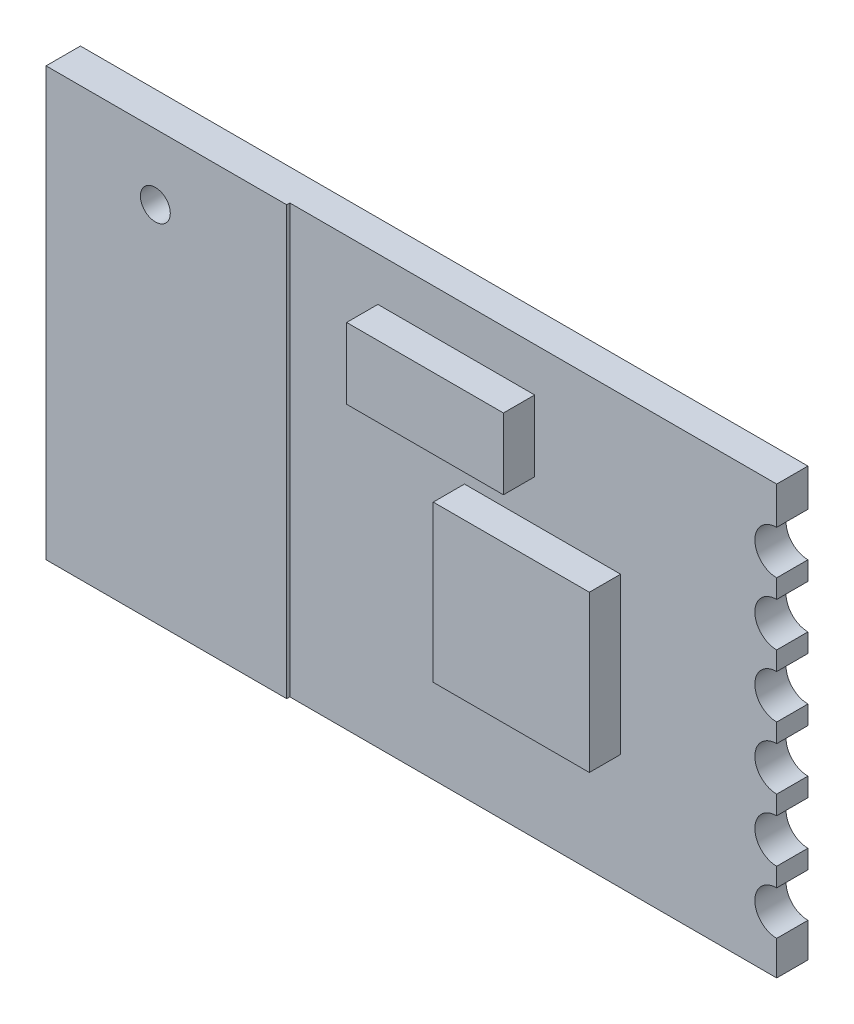
ISO-10303-21;
HEADER;
FILE_DESCRIPTION(('STEP AP214'),'2;1');
FILE_NAME('part.step','',(''),(''),'','','');
FILE_SCHEMA(('AUTOMOTIVE_DESIGN { 1 0 10303 214 1 1 1 1 }'));
ENDSEC;
DATA;
#1=APPLICATION_CONTEXT('core data for automotive mechanical design processes');
#2=APPLICATION_PROTOCOL_DEFINITION('international standard','automotive_design',2000,#1);
#3=PRODUCT_CONTEXT('',#1,'mechanical');
#4=PRODUCT('Part','Part','',(#3));
#5=PRODUCT_RELATED_PRODUCT_CATEGORY('part','',(#4));
#6=PRODUCT_DEFINITION_FORMATION('','',#4);
#7=PRODUCT_DEFINITION_CONTEXT('part definition',#1,'design');
#8=PRODUCT_DEFINITION('design','',#6,#7);
#9=PRODUCT_DEFINITION_SHAPE('','',#8);
#10=(LENGTH_UNIT() NAMED_UNIT(*) SI_UNIT(.MILLI.,.METRE.));
#11=(NAMED_UNIT(*) PLANE_ANGLE_UNIT() SI_UNIT($,.RADIAN.));
#12=(NAMED_UNIT(*) SI_UNIT($,.STERADIAN.) SOLID_ANGLE_UNIT());
#13=UNCERTAINTY_MEASURE_WITH_UNIT(LENGTH_MEASURE(1.E-05),#10,'distance_accuracy_value','');
#14=(GEOMETRIC_REPRESENTATION_CONTEXT(3) GLOBAL_UNCERTAINTY_ASSIGNED_CONTEXT((#13)) GLOBAL_UNIT_ASSIGNED_CONTEXT((#10,
#11,#12)) REPRESENTATION_CONTEXT('',''));
#15=CARTESIAN_POINT('',(0.,0.,0.));
#16=DIRECTION('',(0.,0.,1.));
#17=DIRECTION('',(1.,0.,0.));
#18=AXIS2_PLACEMENT_3D('',#15,#16,#17);
#19=CARTESIAN_POINT('',(13.8178147758854,-3.99327868852459,1.));
#20=DIRECTION('',(0.,0.,1.));
#21=DIRECTION('',(1.,0.,0.));
#22=AXIS2_PLACEMENT_3D('',#19,#20,#21);
#23=PLANE('',#22);
#24=DIRECTION('',(0.,1.,0.));
#25=VECTOR('',#24,1.);
#26=CARTESIAN_POINT('',(-1.77613559259528,7.90672131147541,1.));
#27=LINE('',#26,#25);
#28=CARTESIAN_POINT('',(-1.77613559259528,-5.79327868852459,1.));
#29=VERTEX_POINT('',#28);
#30=CARTESIAN_POINT('',(-1.77613559259528,7.90672131147541,1.));
#31=VERTEX_POINT('',#30);
#32=EDGE_CURVE('E294',#29,#31,#27,.T.);
#33=ORIENTED_EDGE('',*,*,#32,.F.);
#34=DIRECTION('',(1.,0.,0.));
#35=VECTOR('',#34,1.);
#36=CARTESIAN_POINT('',(-9.48218522411463,-5.79327868852459,1.));
#37=LINE('',#36,#35);
#38=CARTESIAN_POINT('',(13.8178147758854,-5.79327868852459,1.));
#39=VERTEX_POINT('',#38);
#40=EDGE_CURVE('E321',#29,#39,#37,.T.);
#41=ORIENTED_EDGE('',*,*,#40,.T.);
#42=DIRECTION('',(0.,1.,0.));
#43=VECTOR('',#42,1.);
#44=CARTESIAN_POINT('',(13.8178147758854,-4.69327868852459,1.));
#45=LINE('',#44,#43);
#46=CARTESIAN_POINT('',(13.8178147758854,-4.69327868852459,1.));
#47=VERTEX_POINT('',#46);
#48=EDGE_CURVE('E324',#39,#47,#45,.T.);
#49=ORIENTED_EDGE('',*,*,#48,.T.);
#50=CARTESIAN_POINT('',(13.8178147758854,-3.99327868852459,1.));
#51=DIRECTION('',(0.,0.,-1.));
#52=DIRECTION('',(1.,0.,0.));
#53=AXIS2_PLACEMENT_3D('',#50,#51,#52);
#54=CIRCLE('',#53,0.699999999999999);
#55=CARTESIAN_POINT('',(13.8178147758854,-3.29327868852459,1.));
#56=VERTEX_POINT('',#55);
#57=EDGE_CURVE('E328',#47,#56,#54,.T.);
#58=ORIENTED_EDGE('',*,*,#57,.T.);
#59=DIRECTION('',(0.,1.,0.));
#60=VECTOR('',#59,1.);
#61=CARTESIAN_POINT('',(13.8178147758854,-2.69327868852459,1.));
#62=LINE('',#61,#60);
#63=CARTESIAN_POINT('',(13.8178147758854,-2.69327868852459,1.));
#64=VERTEX_POINT('',#63);
#65=EDGE_CURVE('E331',#56,#64,#62,.T.);
#66=ORIENTED_EDGE('',*,*,#65,.T.);
#67=CARTESIAN_POINT('',(13.8178147758854,-1.99327868852459,1.));
#68=DIRECTION('',(0.,0.,-1.));
#69=DIRECTION('',(1.,0.,0.));
#70=AXIS2_PLACEMENT_3D('',#67,#68,#69);
#71=CIRCLE('',#70,0.7);
#72=CARTESIAN_POINT('',(13.8178147758854,-1.29327868852459,1.));
#73=VERTEX_POINT('',#72);
#74=EDGE_CURVE('E334',#64,#73,#71,.T.);
#75=ORIENTED_EDGE('',*,*,#74,.T.);
#76=DIRECTION('',(0.,1.,0.));
#77=VECTOR('',#76,1.);
#78=CARTESIAN_POINT('',(13.8178147758854,-0.693278688524589,1.));
#79=LINE('',#78,#77);
#80=CARTESIAN_POINT('',(13.8178147758854,-0.693278688524589,1.));
#81=VERTEX_POINT('',#80);
#82=EDGE_CURVE('E337',#73,#81,#79,.T.);
#83=ORIENTED_EDGE('',*,*,#82,.T.);
#84=CARTESIAN_POINT('',(13.8178147758854,0.00672131147541003,1.));
#85=DIRECTION('',(0.,0.,-1.));
#86=DIRECTION('',(1.,0.,0.));
#87=AXIS2_PLACEMENT_3D('',#84,#85,#86);
#88=CIRCLE('',#87,0.699999999999999);
#89=CARTESIAN_POINT('',(13.8178147758854,0.70672131147541,1.));
#90=VERTEX_POINT('',#89);
#91=EDGE_CURVE('E340',#81,#90,#88,.T.);
#92=ORIENTED_EDGE('',*,*,#91,.T.);
#93=DIRECTION('',(0.,1.,0.));
#94=VECTOR('',#93,1.);
#95=CARTESIAN_POINT('',(13.8178147758854,1.30672131147541,1.));
#96=LINE('',#95,#94);
#97=CARTESIAN_POINT('',(13.8178147758854,1.30672131147541,1.));
#98=VERTEX_POINT('',#97);
#99=EDGE_CURVE('E343',#90,#98,#96,.T.);
#100=ORIENTED_EDGE('',*,*,#99,.T.);
#101=CARTESIAN_POINT('',(13.8178147758854,2.00672131147541,1.));
#102=DIRECTION('',(0.,0.,-1.));
#103=DIRECTION('',(1.,0.,0.));
#104=AXIS2_PLACEMENT_3D('',#101,#102,#103);
#105=CIRCLE('',#104,0.7);
#106=CARTESIAN_POINT('',(13.8178147758854,2.70672131147541,1.));
#107=VERTEX_POINT('',#106);
#108=EDGE_CURVE('E346',#98,#107,#105,.T.);
#109=ORIENTED_EDGE('',*,*,#108,.T.);
#110=DIRECTION('',(0.,1.,0.));
#111=VECTOR('',#110,1.);
#112=CARTESIAN_POINT('',(13.8178147758854,3.30672131147541,1.));
#113=LINE('',#112,#111);
#114=CARTESIAN_POINT('',(13.8178147758854,3.30672131147541,1.));
#115=VERTEX_POINT('',#114);
#116=EDGE_CURVE('E349',#107,#115,#113,.T.);
#117=ORIENTED_EDGE('',*,*,#116,.T.);
#118=CARTESIAN_POINT('',(13.8178147758854,4.00672131147541,1.));
#119=DIRECTION('',(0.,0.,-1.));
#120=DIRECTION('',(1.,0.,0.));
#121=AXIS2_PLACEMENT_3D('',#118,#119,#120);
#122=CIRCLE('',#121,0.7);
#123=CARTESIAN_POINT('',(13.8178147758854,4.70672131147541,1.));
#124=VERTEX_POINT('',#123);
#125=EDGE_CURVE('E352',#115,#124,#122,.T.);
#126=ORIENTED_EDGE('',*,*,#125,.T.);
#127=DIRECTION('',(0.,1.,0.));
#128=VECTOR('',#127,1.);
#129=CARTESIAN_POINT('',(13.8178147758854,5.30672131147541,1.));
#130=LINE('',#129,#128);
#131=CARTESIAN_POINT('',(13.8178147758854,5.30672131147541,1.));
#132=VERTEX_POINT('',#131);
#133=EDGE_CURVE('E355',#124,#132,#130,.T.);
#134=ORIENTED_EDGE('',*,*,#133,.T.);
#135=CARTESIAN_POINT('',(13.8178147758854,6.00672131147541,1.));
#136=DIRECTION('',(0.,0.,-1.));
#137=DIRECTION('',(1.,0.,0.));
#138=AXIS2_PLACEMENT_3D('',#135,#136,#137);
#139=CIRCLE('',#138,0.699999999999999);
#140=CARTESIAN_POINT('',(13.8178147758854,6.70672131147541,1.));
#141=VERTEX_POINT('',#140);
#142=EDGE_CURVE('E358',#132,#141,#139,.T.);
#143=ORIENTED_EDGE('',*,*,#142,.T.);
#144=DIRECTION('',(0.,1.,0.));
#145=VECTOR('',#144,1.);
#146=CARTESIAN_POINT('',(13.8178147758854,7.90672131147541,1.));
#147=LINE('',#146,#145);
#148=CARTESIAN_POINT('',(13.8178147758854,7.90672131147541,1.));
#149=VERTEX_POINT('',#148);
#150=EDGE_CURVE('E361',#141,#149,#147,.T.);
#151=ORIENTED_EDGE('',*,*,#150,.T.);
#152=DIRECTION('',(-1.,0.,0.));
#153=VECTOR('',#152,1.);
#154=CARTESIAN_POINT('',(-9.48218522411463,7.90672131147541,1.));
#155=LINE('',#154,#153);
#156=EDGE_CURVE('E364',#149,#31,#155,.T.);
#157=ORIENTED_EDGE('',*,*,#156,.T.);
#158=EDGE_LOOP('',(#33,#41,#49,#58,#66,#75,#83,#92,#100,#109,#117,#126,#134,#143,#151,#157));
#159=FACE_BOUND('',#158,.T.);
#160=DIRECTION('',(1.,0.,0.));
#161=VECTOR('',#160,1.);
#162=CARTESIAN_POINT('',(3.81781477588537,-2.09327868852459,1.));
#163=LINE('',#162,#161);
#164=CARTESIAN_POINT('',(3.81781477588537,-2.09327868852459,1.));
#165=VERTEX_POINT('',#164);
#166=CARTESIAN_POINT('',(8.81781477588537,-2.09327868852459,1.));
#167=VERTEX_POINT('',#166);
#168=EDGE_CURVE('E247',#165,#167,#163,.T.);
#169=ORIENTED_EDGE('',*,*,#168,.F.);
#170=DIRECTION('',(0.,-1.,0.));
#171=VECTOR('',#170,1.);
#172=CARTESIAN_POINT('',(3.81781477588537,2.90672131147541,1.));
#173=LINE('',#172,#171);
#174=CARTESIAN_POINT('',(3.81781477588537,2.90672131147541,1.));
#175=VERTEX_POINT('',#174);
#176=EDGE_CURVE('E242',#175,#165,#173,.T.);
#177=ORIENTED_EDGE('',*,*,#176,.F.);
#178=DIRECTION('',(-1.,0.,0.));
#179=VECTOR('',#178,1.);
#180=CARTESIAN_POINT('',(3.81781477588537,2.90672131147541,1.));
#181=LINE('',#180,#179);
#182=CARTESIAN_POINT('',(8.81781477588537,2.90672131147541,1.));
#183=VERTEX_POINT('',#182);
#184=EDGE_CURVE('E257',#183,#175,#181,.T.);
#185=ORIENTED_EDGE('',*,*,#184,.F.);
#186=DIRECTION('',(0.,1.,0.));
#187=VECTOR('',#186,1.);
#188=CARTESIAN_POINT('',(8.81781477588537,2.90672131147541,1.));
#189=LINE('',#188,#187);
#190=EDGE_CURVE('E269',#167,#183,#189,.T.);
#191=ORIENTED_EDGE('',*,*,#190,.F.);
#192=EDGE_LOOP('',(#169,#177,#185,#191));
#193=FACE_BOUND('',#192,.T.);
#194=DIRECTION('',(1.,0.,0.));
#195=VECTOR('',#194,1.);
#196=CARTESIAN_POINT('',(1.04424751974844,4.23251855586244,1.));
#197=LINE('',#196,#195);
#198=CARTESIAN_POINT('',(1.04424751974844,4.23251855586244,1.));
#199=VERTEX_POINT('',#198);
#200=CARTESIAN_POINT('',(6.06590525636043,4.23251855586244,1.));
#201=VERTEX_POINT('',#200);
#202=EDGE_CURVE('E840',#199,#201,#197,.T.);
#203=ORIENTED_EDGE('',*,*,#202,.F.);
#204=DIRECTION('',(0.,-1.,0.));
#205=VECTOR('',#204,1.);
#206=CARTESIAN_POINT('',(1.04424751974844,6.5025830121391,1.));
#207=LINE('',#206,#205);
#208=CARTESIAN_POINT('',(1.04424751974844,6.5025830121391,1.));
#209=VERTEX_POINT('',#208);
#210=EDGE_CURVE('E239',#209,#199,#207,.T.);
#211=ORIENTED_EDGE('',*,*,#210,.F.);
#212=DIRECTION('',(-1.,0.,0.));
#213=VECTOR('',#212,1.);
#214=CARTESIAN_POINT('',(1.04424751974844,6.5025830121391,1.));
#215=LINE('',#214,#213);
#216=CARTESIAN_POINT('',(6.06590525636043,6.5025830121391,1.));
#217=VERTEX_POINT('',#216);
#218=EDGE_CURVE('E235',#217,#209,#215,.T.);
#219=ORIENTED_EDGE('',*,*,#218,.F.);
#220=DIRECTION('',(0.,1.,0.));
#221=VECTOR('',#220,1.);
#222=CARTESIAN_POINT('',(6.06590525636043,6.5025830121391,1.));
#223=LINE('',#222,#221);
#224=EDGE_CURVE('E836',#201,#217,#223,.T.);
#225=ORIENTED_EDGE('',*,*,#224,.F.);
#226=EDGE_LOOP('',(#203,#211,#219,#225));
#227=FACE_BOUND('',#226,.T.);
#228=ADVANCED_FACE('F39',(#159,#193,#227),#23,.T.);
#229=CARTESIAN_POINT('',(-9.48218522411463,7.90672131147541,1.));
#230=DIRECTION('',(1.,0.,0.));
#231=DIRECTION('',(0.,1.,0.));
#232=AXIS2_PLACEMENT_3D('',#229,#230,#231);
#233=PLANE('',#232);
#234=DIRECTION('',(0.,-1.,0.));
#235=VECTOR('',#234,1.);
#236=CARTESIAN_POINT('',(-9.48218522411463,7.90672131147541,0.));
#237=LINE('',#236,#235);
#238=CARTESIAN_POINT('',(-9.48218522411463,7.90672131147541,0.));
#239=VERTEX_POINT('',#238);
#240=CARTESIAN_POINT('',(-9.48218522411463,-5.79327868852459,0.));
#241=VERTEX_POINT('',#240);
#242=EDGE_CURVE('E320',#239,#241,#237,.T.);
#243=ORIENTED_EDGE('',*,*,#242,.T.);
#244=DIRECTION('',(0.,0.,-1.));
#245=VECTOR('',#244,1.);
#246=CARTESIAN_POINT('',(-9.48218522411463,-5.79327868852459,1.));
#247=LINE('',#246,#245);
#248=CARTESIAN_POINT('',(-9.48218522411463,-5.79327868852459,1.1));
#249=VERTEX_POINT('',#248);
#250=EDGE_CURVE('E11',#249,#241,#247,.T.);
#251=ORIENTED_EDGE('',*,*,#250,.F.);
#252=DIRECTION('',(0.,-1.,0.));
#253=VECTOR('',#252,1.);
#254=CARTESIAN_POINT('',(-9.48218522411463,7.90672131147541,1.1));
#255=LINE('',#254,#253);
#256=CARTESIAN_POINT('',(-9.48218522411463,7.90672131147541,1.1));
#257=VERTEX_POINT('',#256);
#258=EDGE_CURVE('E295',#257,#249,#255,.T.);
#259=ORIENTED_EDGE('',*,*,#258,.F.);
#260=DIRECTION('',(0.,0.,-1.));
#261=VECTOR('',#260,1.);
#262=CARTESIAN_POINT('',(-9.48218522411463,7.90672131147541,1.));
#263=LINE('',#262,#261);
#264=EDGE_CURVE('E367',#257,#239,#263,.T.);
#265=ORIENTED_EDGE('',*,*,#264,.T.);
#266=EDGE_LOOP('',(#243,#251,#259,#265));
#267=FACE_BOUND('',#266,.T.);
#268=ADVANCED_FACE('F41',(#267),#233,.F.);
#269=CARTESIAN_POINT('',(-9.48218522411463,-5.79327868852459,1.));
#270=DIRECTION('',(0.,1.,0.));
#271=DIRECTION('',(0.,0.,1.));
#272=AXIS2_PLACEMENT_3D('',#269,#270,#271);
#273=PLANE('',#272);
#274=DIRECTION('',(1.,0.,0.));
#275=VECTOR('',#274,1.);
#276=CARTESIAN_POINT('',(-9.48218522411463,-5.79327868852459,0.));
#277=LINE('',#276,#275);
#278=CARTESIAN_POINT('',(13.8178147758854,-5.79327868852459,0.));
#279=VERTEX_POINT('',#278);
#280=EDGE_CURVE('E371',#241,#279,#277,.T.);
#281=ORIENTED_EDGE('',*,*,#280,.T.);
#282=DIRECTION('',(0.,0.,-1.));
#283=VECTOR('',#282,1.);
#284=CARTESIAN_POINT('',(13.8178147758854,-5.79327868852459,1.));
#285=LINE('',#284,#283);
#286=EDGE_CURVE('E48',#39,#279,#285,.T.);
#287=ORIENTED_EDGE('',*,*,#286,.F.);
#288=ORIENTED_EDGE('',*,*,#40,.F.);
#289=DIRECTION('',(0.,0.,-1.));
#290=VECTOR('',#289,1.);
#291=CARTESIAN_POINT('',(-1.77613559259528,-5.79327868852459,1.1));
#292=LINE('',#291,#290);
#293=CARTESIAN_POINT('',(-1.77613559259528,-5.79327868852459,1.1));
#294=VERTEX_POINT('',#293);
#295=EDGE_CURVE('E316',#294,#29,#292,.T.);
#296=ORIENTED_EDGE('',*,*,#295,.F.);
#297=DIRECTION('',(1.,0.,0.));
#298=VECTOR('',#297,1.);
#299=CARTESIAN_POINT('',(-9.48218522411463,-5.79327868852459,1.1));
#300=LINE('',#299,#298);
#301=EDGE_CURVE('E299',#249,#294,#300,.T.);
#302=ORIENTED_EDGE('',*,*,#301,.F.);
#303=ORIENTED_EDGE('',*,*,#250,.T.);
#304=EDGE_LOOP('',(#281,#287,#288,#296,#302,#303));
#305=FACE_BOUND('',#304,.T.);
#306=ADVANCED_FACE('F498',(#305),#273,.F.);
#307=CARTESIAN_POINT('',(13.8178147758854,-4.69327868852459,1.));
#308=DIRECTION('',(-1.,0.,0.));
#309=DIRECTION('',(0.,0.,1.));
#310=AXIS2_PLACEMENT_3D('',#307,#308,#309);
#311=PLANE('',#310);
#312=DIRECTION('',(0.,1.,0.));
#313=VECTOR('',#312,1.);
#314=CARTESIAN_POINT('',(13.8178147758854,-4.69327868852459,0.));
#315=LINE('',#314,#313);
#316=CARTESIAN_POINT('',(13.8178147758854,-4.69327868852459,0.));
#317=VERTEX_POINT('',#316);
#318=EDGE_CURVE('E374',#279,#317,#315,.T.);
#319=ORIENTED_EDGE('',*,*,#318,.T.);
#320=DIRECTION('',(0.,0.,-1.));
#321=VECTOR('',#320,1.);
#322=CARTESIAN_POINT('',(13.8178147758854,-4.69327868852459,1.));
#323=LINE('',#322,#321);
#324=EDGE_CURVE('E466',#47,#317,#323,.T.);
#325=ORIENTED_EDGE('',*,*,#324,.F.);
#326=ORIENTED_EDGE('',*,*,#48,.F.);
#327=ORIENTED_EDGE('',*,*,#286,.T.);
#328=EDGE_LOOP('',(#319,#325,#326,#327));
#329=FACE_BOUND('',#328,.T.);
#330=ADVANCED_FACE('F475',(#329),#311,.F.);
#331=CARTESIAN_POINT('',(13.8178147758854,-3.99327868852459,1.));
#332=DIRECTION('',(0.,0.,-1.));
#333=DIRECTION('',(-1.,0.,0.));
#334=AXIS2_PLACEMENT_3D('',#331,#332,#333);
#335=CYLINDRICAL_SURFACE('',#334,0.699999999999999);
#336=CARTESIAN_POINT('',(13.8178147758854,-3.99327868852459,0.));
#337=DIRECTION('',(0.,0.,-1.));
#338=DIRECTION('',(1.,0.,0.));
#339=AXIS2_PLACEMENT_3D('',#336,#337,#338);
#340=CIRCLE('',#339,0.699999999999999);
#341=CARTESIAN_POINT('',(13.8178147758854,-3.29327868852459,0.));
#342=VERTEX_POINT('',#341);
#343=EDGE_CURVE('E377',#317,#342,#340,.T.);
#344=ORIENTED_EDGE('',*,*,#343,.T.);
#345=DIRECTION('',(0.,0.,-1.));
#346=VECTOR('',#345,1.);
#347=CARTESIAN_POINT('',(13.8178147758854,-3.29327868852459,1.));
#348=LINE('',#347,#346);
#349=EDGE_CURVE('E462',#56,#342,#348,.T.);
#350=ORIENTED_EDGE('',*,*,#349,.F.);
#351=ORIENTED_EDGE('',*,*,#57,.F.);
#352=ORIENTED_EDGE('',*,*,#324,.T.);
#353=EDGE_LOOP('',(#344,#350,#351,#352));
#354=FACE_BOUND('',#353,.T.);
#355=ADVANCED_FACE('F487',(#354),#335,.F.);
#356=CARTESIAN_POINT('',(13.8178147758854,-2.69327868852459,1.));
#357=DIRECTION('',(-1.,0.,0.));
#358=DIRECTION('',(0.,0.,1.));
#359=AXIS2_PLACEMENT_3D('',#356,#357,#358);
#360=PLANE('',#359);
#361=DIRECTION('',(0.,1.,0.));
#362=VECTOR('',#361,1.);
#363=CARTESIAN_POINT('',(13.8178147758854,-2.69327868852459,0.));
#364=LINE('',#363,#362);
#365=CARTESIAN_POINT('',(13.8178147758854,-2.69327868852459,0.));
#366=VERTEX_POINT('',#365);
#367=EDGE_CURVE('E380',#342,#366,#364,.T.);
#368=ORIENTED_EDGE('',*,*,#367,.T.);
#369=DIRECTION('',(0.,0.,-1.));
#370=VECTOR('',#369,1.);
#371=CARTESIAN_POINT('',(13.8178147758854,-2.69327868852459,1.));
#372=LINE('',#371,#370);
#373=EDGE_CURVE('E458',#64,#366,#372,.T.);
#374=ORIENTED_EDGE('',*,*,#373,.F.);
#375=ORIENTED_EDGE('',*,*,#65,.F.);
#376=ORIENTED_EDGE('',*,*,#349,.T.);
#377=EDGE_LOOP('',(#368,#374,#375,#376));
#378=FACE_BOUND('',#377,.T.);
#379=ADVANCED_FACE('F491',(#378),#360,.F.);
#380=CARTESIAN_POINT('',(13.8178147758854,-1.99327868852459,1.));
#381=DIRECTION('',(0.,0.,-1.));
#382=DIRECTION('',(-1.,0.,0.));
#383=AXIS2_PLACEMENT_3D('',#380,#381,#382);
#384=CYLINDRICAL_SURFACE('',#383,0.7);
#385=CARTESIAN_POINT('',(13.8178147758854,-1.99327868852459,0.));
#386=DIRECTION('',(0.,0.,-1.));
#387=DIRECTION('',(1.,0.,0.));
#388=AXIS2_PLACEMENT_3D('',#385,#386,#387);
#389=CIRCLE('',#388,0.7);
#390=CARTESIAN_POINT('',(13.8178147758854,-1.29327868852459,0.));
#391=VERTEX_POINT('',#390);
#392=EDGE_CURVE('E383',#366,#391,#389,.T.);
#393=ORIENTED_EDGE('',*,*,#392,.T.);
#394=DIRECTION('',(0.,0.,-1.));
#395=VECTOR('',#394,1.);
#396=CARTESIAN_POINT('',(13.8178147758854,-1.29327868852459,1.));
#397=LINE('',#396,#395);
#398=EDGE_CURVE('E454',#73,#391,#397,.T.);
#399=ORIENTED_EDGE('',*,*,#398,.F.);
#400=ORIENTED_EDGE('',*,*,#74,.F.);
#401=ORIENTED_EDGE('',*,*,#373,.T.);
#402=EDGE_LOOP('',(#393,#399,#400,#401));
#403=FACE_BOUND('',#402,.T.);
#404=ADVANCED_FACE('F559',(#403),#384,.F.);
#405=CARTESIAN_POINT('',(13.8178147758854,-0.693278688524589,1.));
#406=DIRECTION('',(-1.,0.,0.));
#407=DIRECTION('',(0.,0.,1.));
#408=AXIS2_PLACEMENT_3D('',#405,#406,#407);
#409=PLANE('',#408);
#410=DIRECTION('',(0.,1.,0.));
#411=VECTOR('',#410,1.);
#412=CARTESIAN_POINT('',(13.8178147758854,-0.693278688524589,0.));
#413=LINE('',#412,#411);
#414=CARTESIAN_POINT('',(13.8178147758854,-0.693278688524589,0.));
#415=VERTEX_POINT('',#414);
#416=EDGE_CURVE('E386',#391,#415,#413,.T.);
#417=ORIENTED_EDGE('',*,*,#416,.T.);
#418=DIRECTION('',(0.,0.,-1.));
#419=VECTOR('',#418,1.);
#420=CARTESIAN_POINT('',(13.8178147758854,-0.693278688524589,1.));
#421=LINE('',#420,#419);
#422=EDGE_CURVE('E450',#81,#415,#421,.T.);
#423=ORIENTED_EDGE('',*,*,#422,.F.);
#424=ORIENTED_EDGE('',*,*,#82,.F.);
#425=ORIENTED_EDGE('',*,*,#398,.T.);
#426=EDGE_LOOP('',(#417,#423,#424,#425));
#427=FACE_BOUND('',#426,.T.);
#428=ADVANCED_FACE('F556',(#427),#409,.F.);
#429=CARTESIAN_POINT('',(13.8178147758854,0.00672131147541003,1.));
#430=DIRECTION('',(0.,0.,-1.));
#431=DIRECTION('',(-1.,0.,0.));
#432=AXIS2_PLACEMENT_3D('',#429,#430,#431);
#433=CYLINDRICAL_SURFACE('',#432,0.699999999999999);
#434=CARTESIAN_POINT('',(13.8178147758854,0.00672131147541003,0.));
#435=DIRECTION('',(0.,0.,-1.));
#436=DIRECTION('',(1.,0.,0.));
#437=AXIS2_PLACEMENT_3D('',#434,#435,#436);
#438=CIRCLE('',#437,0.699999999999999);
#439=CARTESIAN_POINT('',(13.8178147758854,0.70672131147541,0.));
#440=VERTEX_POINT('',#439);
#441=EDGE_CURVE('E389',#415,#440,#438,.T.);
#442=ORIENTED_EDGE('',*,*,#441,.T.);
#443=DIRECTION('',(0.,0.,-1.));
#444=VECTOR('',#443,1.);
#445=CARTESIAN_POINT('',(13.8178147758854,0.70672131147541,1.));
#446=LINE('',#445,#444);
#447=EDGE_CURVE('E446',#90,#440,#446,.T.);
#448=ORIENTED_EDGE('',*,*,#447,.F.);
#449=ORIENTED_EDGE('',*,*,#91,.F.);
#450=ORIENTED_EDGE('',*,*,#422,.T.);
#451=EDGE_LOOP('',(#442,#448,#449,#450));
#452=FACE_BOUND('',#451,.T.);
#453=ADVANCED_FACE('F552',(#452),#433,.F.);
#454=CARTESIAN_POINT('',(13.8178147758854,1.30672131147541,1.));
#455=DIRECTION('',(-1.,0.,0.));
#456=DIRECTION('',(0.,0.,1.));
#457=AXIS2_PLACEMENT_3D('',#454,#455,#456);
#458=PLANE('',#457);
#459=DIRECTION('',(0.,1.,0.));
#460=VECTOR('',#459,1.);
#461=CARTESIAN_POINT('',(13.8178147758854,1.30672131147541,0.));
#462=LINE('',#461,#460);
#463=CARTESIAN_POINT('',(13.8178147758854,1.30672131147541,0.));
#464=VERTEX_POINT('',#463);
#465=EDGE_CURVE('E392',#440,#464,#462,.T.);
#466=ORIENTED_EDGE('',*,*,#465,.T.);
#467=DIRECTION('',(0.,0.,-1.));
#468=VECTOR('',#467,1.);
#469=CARTESIAN_POINT('',(13.8178147758854,1.30672131147541,1.));
#470=LINE('',#469,#468);
#471=EDGE_CURVE('E442',#98,#464,#470,.T.);
#472=ORIENTED_EDGE('',*,*,#471,.F.);
#473=ORIENTED_EDGE('',*,*,#99,.F.);
#474=ORIENTED_EDGE('',*,*,#447,.T.);
#475=EDGE_LOOP('',(#466,#472,#473,#474));
#476=FACE_BOUND('',#475,.T.);
#477=ADVANCED_FACE('F548',(#476),#458,.F.);
#478=CARTESIAN_POINT('',(13.8178147758854,2.00672131147541,1.));
#479=DIRECTION('',(0.,0.,-1.));
#480=DIRECTION('',(-1.,0.,0.));
#481=AXIS2_PLACEMENT_3D('',#478,#479,#480);
#482=CYLINDRICAL_SURFACE('',#481,0.7);
#483=CARTESIAN_POINT('',(13.8178147758854,2.00672131147541,0.));
#484=DIRECTION('',(0.,0.,-1.));
#485=DIRECTION('',(1.,0.,0.));
#486=AXIS2_PLACEMENT_3D('',#483,#484,#485);
#487=CIRCLE('',#486,0.7);
#488=CARTESIAN_POINT('',(13.8178147758854,2.70672131147541,0.));
#489=VERTEX_POINT('',#488);
#490=EDGE_CURVE('E395',#464,#489,#487,.T.);
#491=ORIENTED_EDGE('',*,*,#490,.T.);
#492=DIRECTION('',(0.,0.,-1.));
#493=VECTOR('',#492,1.);
#494=CARTESIAN_POINT('',(13.8178147758854,2.70672131147541,1.));
#495=LINE('',#494,#493);
#496=EDGE_CURVE('E438',#107,#489,#495,.T.);
#497=ORIENTED_EDGE('',*,*,#496,.F.);
#498=ORIENTED_EDGE('',*,*,#108,.F.);
#499=ORIENTED_EDGE('',*,*,#471,.T.);
#500=EDGE_LOOP('',(#491,#497,#498,#499));
#501=FACE_BOUND('',#500,.T.);
#502=ADVANCED_FACE('F543',(#501),#482,.F.);
#503=CARTESIAN_POINT('',(13.8178147758854,3.30672131147541,1.));
#504=DIRECTION('',(-1.,0.,0.));
#505=DIRECTION('',(0.,0.,1.));
#506=AXIS2_PLACEMENT_3D('',#503,#504,#505);
#507=PLANE('',#506);
#508=DIRECTION('',(0.,1.,0.));
#509=VECTOR('',#508,1.);
#510=CARTESIAN_POINT('',(13.8178147758854,3.30672131147541,0.));
#511=LINE('',#510,#509);
#512=CARTESIAN_POINT('',(13.8178147758854,3.30672131147541,0.));
#513=VERTEX_POINT('',#512);
#514=EDGE_CURVE('E398',#489,#513,#511,.T.);
#515=ORIENTED_EDGE('',*,*,#514,.T.);
#516=DIRECTION('',(0.,0.,-1.));
#517=VECTOR('',#516,1.);
#518=CARTESIAN_POINT('',(13.8178147758854,3.30672131147541,1.));
#519=LINE('',#518,#517);
#520=EDGE_CURVE('E434',#115,#513,#519,.T.);
#521=ORIENTED_EDGE('',*,*,#520,.F.);
#522=ORIENTED_EDGE('',*,*,#116,.F.);
#523=ORIENTED_EDGE('',*,*,#496,.T.);
#524=EDGE_LOOP('',(#515,#521,#522,#523));
#525=FACE_BOUND('',#524,.T.);
#526=ADVANCED_FACE('F537',(#525),#507,.F.);
#527=CARTESIAN_POINT('',(13.8178147758854,4.00672131147541,1.));
#528=DIRECTION('',(0.,0.,-1.));
#529=DIRECTION('',(-1.,0.,0.));
#530=AXIS2_PLACEMENT_3D('',#527,#528,#529);
#531=CYLINDRICAL_SURFACE('',#530,0.7);
#532=CARTESIAN_POINT('',(13.8178147758854,4.00672131147541,0.));
#533=DIRECTION('',(0.,0.,-1.));
#534=DIRECTION('',(1.,0.,0.));
#535=AXIS2_PLACEMENT_3D('',#532,#533,#534);
#536=CIRCLE('',#535,0.7);
#537=CARTESIAN_POINT('',(13.8178147758854,4.70672131147541,0.));
#538=VERTEX_POINT('',#537);
#539=EDGE_CURVE('E401',#513,#538,#536,.T.);
#540=ORIENTED_EDGE('',*,*,#539,.T.);
#541=DIRECTION('',(0.,0.,-1.));
#542=VECTOR('',#541,1.);
#543=CARTESIAN_POINT('',(13.8178147758854,4.70672131147541,1.));
#544=LINE('',#543,#542);
#545=EDGE_CURVE('E430',#124,#538,#544,.T.);
#546=ORIENTED_EDGE('',*,*,#545,.F.);
#547=ORIENTED_EDGE('',*,*,#125,.F.);
#548=ORIENTED_EDGE('',*,*,#520,.T.);
#549=EDGE_LOOP('',(#540,#546,#547,#548));
#550=FACE_BOUND('',#549,.T.);
#551=ADVANCED_FACE('F533',(#550),#531,.F.);
#552=CARTESIAN_POINT('',(13.8178147758854,5.30672131147541,1.));
#553=DIRECTION('',(-1.,0.,0.));
#554=DIRECTION('',(0.,0.,1.));
#555=AXIS2_PLACEMENT_3D('',#552,#553,#554);
#556=PLANE('',#555);
#557=DIRECTION('',(0.,1.,0.));
#558=VECTOR('',#557,1.);
#559=CARTESIAN_POINT('',(13.8178147758854,5.30672131147541,0.));
#560=LINE('',#559,#558);
#561=CARTESIAN_POINT('',(13.8178147758854,5.30672131147541,0.));
#562=VERTEX_POINT('',#561);
#563=EDGE_CURVE('E404',#538,#562,#560,.T.);
#564=ORIENTED_EDGE('',*,*,#563,.T.);
#565=DIRECTION('',(0.,0.,-1.));
#566=VECTOR('',#565,1.);
#567=CARTESIAN_POINT('',(13.8178147758854,5.30672131147541,1.));
#568=LINE('',#567,#566);
#569=EDGE_CURVE('E426',#132,#562,#568,.T.);
#570=ORIENTED_EDGE('',*,*,#569,.F.);
#571=ORIENTED_EDGE('',*,*,#133,.F.);
#572=ORIENTED_EDGE('',*,*,#545,.T.);
#573=EDGE_LOOP('',(#564,#570,#571,#572));
#574=FACE_BOUND('',#573,.T.);
#575=ADVANCED_FACE('F528',(#574),#556,.F.);
#576=CARTESIAN_POINT('',(13.8178147758854,6.00672131147541,1.));
#577=DIRECTION('',(0.,0.,-1.));
#578=DIRECTION('',(-1.,0.,0.));
#579=AXIS2_PLACEMENT_3D('',#576,#577,#578);
#580=CYLINDRICAL_SURFACE('',#579,0.699999999999999);
#581=CARTESIAN_POINT('',(13.8178147758854,6.00672131147541,0.));
#582=DIRECTION('',(0.,0.,-1.));
#583=DIRECTION('',(1.,0.,0.));
#584=AXIS2_PLACEMENT_3D('',#581,#582,#583);
#585=CIRCLE('',#584,0.699999999999999);
#586=CARTESIAN_POINT('',(13.8178147758854,6.70672131147541,0.));
#587=VERTEX_POINT('',#586);
#588=EDGE_CURVE('E407',#562,#587,#585,.T.);
#589=ORIENTED_EDGE('',*,*,#588,.T.);
#590=DIRECTION('',(0.,0.,-1.));
#591=VECTOR('',#590,1.);
#592=CARTESIAN_POINT('',(13.8178147758854,6.70672131147541,1.));
#593=LINE('',#592,#591);
#594=EDGE_CURVE('E422',#141,#587,#593,.T.);
#595=ORIENTED_EDGE('',*,*,#594,.F.);
#596=ORIENTED_EDGE('',*,*,#142,.F.);
#597=ORIENTED_EDGE('',*,*,#569,.T.);
#598=EDGE_LOOP('',(#589,#595,#596,#597));
#599=FACE_BOUND('',#598,.T.);
#600=ADVANCED_FACE('F522',(#599),#580,.F.);
#601=CARTESIAN_POINT('',(13.8178147758854,7.90672131147541,1.));
#602=DIRECTION('',(-1.,0.,0.));
#603=DIRECTION('',(0.,0.,1.));
#604=AXIS2_PLACEMENT_3D('',#601,#602,#603);
#605=PLANE('',#604);
#606=DIRECTION('',(0.,1.,0.));
#607=VECTOR('',#606,1.);
#608=CARTESIAN_POINT('',(13.8178147758854,7.90672131147541,0.));
#609=LINE('',#608,#607);
#610=CARTESIAN_POINT('',(13.8178147758854,7.90672131147541,0.));
#611=VERTEX_POINT('',#610);
#612=EDGE_CURVE('E410',#587,#611,#609,.T.);
#613=ORIENTED_EDGE('',*,*,#612,.T.);
#614=DIRECTION('',(0.,0.,-1.));
#615=VECTOR('',#614,1.);
#616=CARTESIAN_POINT('',(13.8178147758854,7.90672131147541,1.));
#617=LINE('',#616,#615);
#618=EDGE_CURVE('E418',#149,#611,#617,.T.);
#619=ORIENTED_EDGE('',*,*,#618,.F.);
#620=ORIENTED_EDGE('',*,*,#150,.F.);
#621=ORIENTED_EDGE('',*,*,#594,.T.);
#622=EDGE_LOOP('',(#613,#619,#620,#621));
#623=FACE_BOUND('',#622,.T.);
#624=ADVANCED_FACE('F518',(#623),#605,.F.);
#625=CARTESIAN_POINT('',(-9.48218522411463,7.90672131147541,1.));
#626=DIRECTION('',(0.,-1.,0.));
#627=DIRECTION('',(0.,0.,-1.));
#628=AXIS2_PLACEMENT_3D('',#625,#626,#627);
#629=PLANE('',#628);
#630=DIRECTION('',(-1.,0.,0.));
#631=VECTOR('',#630,1.);
#632=CARTESIAN_POINT('',(-9.48218522411463,7.90672131147541,0.));
#633=LINE('',#632,#631);
#634=EDGE_CURVE('E325',#611,#239,#633,.T.);
#635=ORIENTED_EDGE('',*,*,#634,.T.);
#636=ORIENTED_EDGE('',*,*,#264,.F.);
#637=DIRECTION('',(-1.,0.,0.));
#638=VECTOR('',#637,1.);
#639=CARTESIAN_POINT('',(-9.48218522411463,7.90672131147541,1.1));
#640=LINE('',#639,#638);
#641=CARTESIAN_POINT('',(-1.77613559259528,7.90672131147541,1.1));
#642=VERTEX_POINT('',#641);
#643=EDGE_CURVE('E305',#642,#257,#640,.T.);
#644=ORIENTED_EDGE('',*,*,#643,.F.);
#645=DIRECTION('',(0.,0.,-1.));
#646=VECTOR('',#645,1.);
#647=CARTESIAN_POINT('',(-1.77613559259528,7.90672131147541,1.1));
#648=LINE('',#647,#646);
#649=EDGE_CURVE('E309',#642,#31,#648,.T.);
#650=ORIENTED_EDGE('',*,*,#649,.T.);
#651=ORIENTED_EDGE('',*,*,#156,.F.);
#652=ORIENTED_EDGE('',*,*,#618,.T.);
#653=EDGE_LOOP('',(#635,#636,#644,#650,#651,#652));
#654=FACE_BOUND('',#653,.T.);
#655=ADVANCED_FACE('F513',(#654),#629,.F.);
#656=CARTESIAN_POINT('',(13.8178147758854,-3.99327868852459,0.));
#657=DIRECTION('',(0.,0.,1.));
#658=DIRECTION('',(1.,0.,0.));
#659=AXIS2_PLACEMENT_3D('',#656,#657,#658);
#660=PLANE('',#659);
#661=CARTESIAN_POINT('',(-5.98218522411463,5.80672131147541,0.));
#662=DIRECTION('',(0.,0.,1.));
#663=DIRECTION('',(1.,0.,0.));
#664=AXIS2_PLACEMENT_3D('',#661,#662,#663);
#665=CIRCLE('',#664,0.478791287242658);
#666=CARTESIAN_POINT('',(-5.50339393687197,5.80672131147541,0.));
#667=VERTEX_POINT('',#666);
#668=EDGE_CURVE('E290',#667,#667,#665,.T.);
#669=ORIENTED_EDGE('',*,*,#668,.T.);
#670=EDGE_LOOP('',(#669));
#671=FACE_BOUND('',#670,.T.);
#672=ORIENTED_EDGE('',*,*,#242,.F.);
#673=ORIENTED_EDGE('',*,*,#634,.F.);
#674=ORIENTED_EDGE('',*,*,#612,.F.);
#675=ORIENTED_EDGE('',*,*,#588,.F.);
#676=ORIENTED_EDGE('',*,*,#563,.F.);
#677=ORIENTED_EDGE('',*,*,#539,.F.);
#678=ORIENTED_EDGE('',*,*,#514,.F.);
#679=ORIENTED_EDGE('',*,*,#490,.F.);
#680=ORIENTED_EDGE('',*,*,#465,.F.);
#681=ORIENTED_EDGE('',*,*,#441,.F.);
#682=ORIENTED_EDGE('',*,*,#416,.F.);
#683=ORIENTED_EDGE('',*,*,#392,.F.);
#684=ORIENTED_EDGE('',*,*,#367,.F.);
#685=ORIENTED_EDGE('',*,*,#343,.F.);
#686=ORIENTED_EDGE('',*,*,#318,.F.);
#687=ORIENTED_EDGE('',*,*,#280,.F.);
#688=EDGE_LOOP('',(#672,#673,#674,#675,#676,#677,#678,#679,#680,#681,#682,#683,#684,#685,#686,#687));
#689=FACE_BOUND('',#688,.T.);
#690=ADVANCED_FACE('F482',(#671,#689),#660,.F.);
#691=CARTESIAN_POINT('',(-1.77613559259528,7.90672131147541,1.1));
#692=DIRECTION('',(-1.,0.,0.));
#693=DIRECTION('',(0.,0.,1.));
#694=AXIS2_PLACEMENT_3D('',#691,#692,#693);
#695=PLANE('',#694);
#696=ORIENTED_EDGE('',*,*,#32,.T.);
#697=ORIENTED_EDGE('',*,*,#649,.F.);
#698=DIRECTION('',(0.,1.,0.));
#699=VECTOR('',#698,1.);
#700=CARTESIAN_POINT('',(-1.77613559259528,7.90672131147541,1.1));
#701=LINE('',#700,#699);
#702=EDGE_CURVE('E302',#294,#642,#701,.T.);
#703=ORIENTED_EDGE('',*,*,#702,.F.);
#704=ORIENTED_EDGE('',*,*,#295,.T.);
#705=EDGE_LOOP('',(#696,#697,#703,#704));
#706=FACE_BOUND('',#705,.T.);
#707=ADVANCED_FACE('F502',(#706),#695,.F.);
#708=CARTESIAN_POINT('',(0.,0.,1.1));
#709=DIRECTION('',(0.,0.,1.));
#710=DIRECTION('',(1.,0.,0.));
#711=AXIS2_PLACEMENT_3D('',#708,#709,#710);
#712=PLANE('',#711);
#713=CARTESIAN_POINT('',(-5.98218522411463,5.80672131147541,1.1));
#714=DIRECTION('',(0.,0.,1.));
#715=DIRECTION('',(1.,0.,0.));
#716=AXIS2_PLACEMENT_3D('',#713,#714,#715);
#717=CIRCLE('',#716,0.478791287242658);
#718=CARTESIAN_POINT('',(-5.50339393687197,5.80672131147541,1.1));
#719=VERTEX_POINT('',#718);
#720=EDGE_CURVE('E286',#719,#719,#717,.T.);
#721=ORIENTED_EDGE('',*,*,#720,.F.);
#722=EDGE_LOOP('',(#721));
#723=FACE_BOUND('',#722,.T.);
#724=ORIENTED_EDGE('',*,*,#258,.T.);
#725=ORIENTED_EDGE('',*,*,#301,.T.);
#726=ORIENTED_EDGE('',*,*,#702,.T.);
#727=ORIENTED_EDGE('',*,*,#643,.T.);
#728=EDGE_LOOP('',(#724,#725,#726,#727));
#729=FACE_BOUND('',#728,.T.);
#730=ADVANCED_FACE('F506',(#723,#729),#712,.T.);
#731=CARTESIAN_POINT('',(-5.98218522411463,5.80672131147541,-1.));
#732=DIRECTION('',(0.,0.,1.));
#733=DIRECTION('',(1.,0.,0.));
#734=AXIS2_PLACEMENT_3D('',#731,#732,#733);
#735=CYLINDRICAL_SURFACE('',#734,0.478791287242658);
#736=ORIENTED_EDGE('',*,*,#720,.T.);
#737=EDGE_LOOP('',(#736));
#738=FACE_BOUND('',#737,.T.);
#739=ORIENTED_EDGE('',*,*,#668,.F.);
#740=EDGE_LOOP('',(#739));
#741=FACE_BOUND('',#740,.T.);
#742=ADVANCED_FACE('F649',(#738,#741),#735,.F.);
#743=CARTESIAN_POINT('',(3.81781477588537,2.90672131147541,2.));
#744=DIRECTION('',(1.,0.,0.));
#745=DIRECTION('',(0.,1.,0.));
#746=AXIS2_PLACEMENT_3D('',#743,#744,#745);
#747=PLANE('',#746);
#748=ORIENTED_EDGE('',*,*,#176,.T.);
#749=DIRECTION('',(0.,0.,-1.));
#750=VECTOR('',#749,1.);
#751=CARTESIAN_POINT('',(3.81781477588537,-2.09327868852459,2.));
#752=LINE('',#751,#750);
#753=CARTESIAN_POINT('',(3.81781477588537,-2.09327868852459,2.));
#754=VERTEX_POINT('',#753);
#755=EDGE_CURVE('E283',#754,#165,#752,.T.);
#756=ORIENTED_EDGE('',*,*,#755,.F.);
#757=DIRECTION('',(0.,-1.,0.));
#758=VECTOR('',#757,1.);
#759=CARTESIAN_POINT('',(3.81781477588537,2.90672131147541,2.));
#760=LINE('',#759,#758);
#761=CARTESIAN_POINT('',(3.81781477588537,2.90672131147541,2.));
#762=VERTEX_POINT('',#761);
#763=EDGE_CURVE('E252',#762,#754,#760,.T.);
#764=ORIENTED_EDGE('',*,*,#763,.F.);
#765=DIRECTION('',(0.,0.,-1.));
#766=VECTOR('',#765,1.);
#767=CARTESIAN_POINT('',(3.81781477588537,2.90672131147541,2.));
#768=LINE('',#767,#766);
#769=EDGE_CURVE('E265',#762,#175,#768,.T.);
#770=ORIENTED_EDGE('',*,*,#769,.T.);
#771=EDGE_LOOP('',(#748,#756,#764,#770));
#772=FACE_BOUND('',#771,.T.);
#773=ADVANCED_FACE('F656',(#772),#747,.F.);
#774=CARTESIAN_POINT('',(3.81781477588537,-2.09327868852459,2.));
#775=DIRECTION('',(0.,1.,0.));
#776=DIRECTION('',(0.,0.,1.));
#777=AXIS2_PLACEMENT_3D('',#774,#775,#776);
#778=PLANE('',#777);
#779=ORIENTED_EDGE('',*,*,#168,.T.);
#780=DIRECTION('',(0.,0.,-1.));
#781=VECTOR('',#780,1.);
#782=CARTESIAN_POINT('',(8.81781477588537,-2.09327868852459,2.));
#783=LINE('',#782,#781);
#784=CARTESIAN_POINT('',(8.81781477588537,-2.09327868852459,2.));
#785=VERTEX_POINT('',#784);
#786=EDGE_CURVE('E279',#785,#167,#783,.T.);
#787=ORIENTED_EDGE('',*,*,#786,.F.);
#788=DIRECTION('',(1.,0.,0.));
#789=VECTOR('',#788,1.);
#790=CARTESIAN_POINT('',(3.81781477588537,-2.09327868852459,2.));
#791=LINE('',#790,#789);
#792=EDGE_CURVE('E256',#754,#785,#791,.T.);
#793=ORIENTED_EDGE('',*,*,#792,.F.);
#794=ORIENTED_EDGE('',*,*,#755,.T.);
#795=EDGE_LOOP('',(#779,#787,#793,#794));
#796=FACE_BOUND('',#795,.T.);
#797=ADVANCED_FACE('F664',(#796),#778,.F.);
#798=CARTESIAN_POINT('',(8.81781477588537,2.90672131147541,2.));
#799=DIRECTION('',(-1.,0.,0.));
#800=DIRECTION('',(0.,-1.,0.));
#801=AXIS2_PLACEMENT_3D('',#798,#799,#800);
#802=PLANE('',#801);
#803=ORIENTED_EDGE('',*,*,#190,.T.);
#804=DIRECTION('',(0.,0.,-1.));
#805=VECTOR('',#804,1.);
#806=CARTESIAN_POINT('',(8.81781477588537,2.90672131147541,2.));
#807=LINE('',#806,#805);
#808=CARTESIAN_POINT('',(8.81781477588537,2.90672131147541,2.));
#809=VERTEX_POINT('',#808);
#810=EDGE_CURVE('E63',#809,#183,#807,.T.);
#811=ORIENTED_EDGE('',*,*,#810,.F.);
#812=DIRECTION('',(0.,1.,0.));
#813=VECTOR('',#812,1.);
#814=CARTESIAN_POINT('',(8.81781477588537,2.90672131147541,2.));
#815=LINE('',#814,#813);
#816=EDGE_CURVE('E260',#785,#809,#815,.T.);
#817=ORIENTED_EDGE('',*,*,#816,.F.);
#818=ORIENTED_EDGE('',*,*,#786,.T.);
#819=EDGE_LOOP('',(#803,#811,#817,#818));
#820=FACE_BOUND('',#819,.T.);
#821=ADVANCED_FACE('F672',(#820),#802,.F.);
#822=CARTESIAN_POINT('',(3.81781477588537,2.90672131147541,2.));
#823=DIRECTION('',(0.,-1.,0.));
#824=DIRECTION('',(0.,0.,-1.));
#825=AXIS2_PLACEMENT_3D('',#822,#823,#824);
#826=PLANE('',#825);
#827=ORIENTED_EDGE('',*,*,#184,.T.);
#828=ORIENTED_EDGE('',*,*,#769,.F.);
#829=DIRECTION('',(-1.,0.,0.));
#830=VECTOR('',#829,1.);
#831=CARTESIAN_POINT('',(3.81781477588537,2.90672131147541,2.));
#832=LINE('',#831,#830);
#833=EDGE_CURVE('E263',#809,#762,#832,.T.);
#834=ORIENTED_EDGE('',*,*,#833,.F.);
#835=ORIENTED_EDGE('',*,*,#810,.T.);
#836=EDGE_LOOP('',(#827,#828,#834,#835));
#837=FACE_BOUND('',#836,.T.);
#838=ADVANCED_FACE('F680',(#837),#826,.F.);
#839=CARTESIAN_POINT('',(0.,0.,2.));
#840=DIRECTION('',(0.,0.,1.));
#841=DIRECTION('',(1.,0.,0.));
#842=AXIS2_PLACEMENT_3D('',#839,#840,#841);
#843=PLANE('',#842);
#844=ORIENTED_EDGE('',*,*,#763,.T.);
#845=ORIENTED_EDGE('',*,*,#792,.T.);
#846=ORIENTED_EDGE('',*,*,#816,.T.);
#847=ORIENTED_EDGE('',*,*,#833,.T.);
#848=EDGE_LOOP('',(#844,#845,#846,#847));
#849=FACE_BOUND('',#848,.T.);
#850=ADVANCED_FACE('F688',(#849),#843,.T.);
#851=CARTESIAN_POINT('',(1.04424751974844,6.5025830121391,2.));
#852=DIRECTION('',(1.,0.,0.));
#853=DIRECTION('',(0.,0.,-1.));
#854=AXIS2_PLACEMENT_3D('',#851,#852,#853);
#855=PLANE('',#854);
#856=ORIENTED_EDGE('',*,*,#210,.T.);
#857=DIRECTION('',(0.,0.,-1.));
#858=VECTOR('',#857,1.);
#859=CARTESIAN_POINT('',(1.04424751974844,4.23251855586244,2.));
#860=LINE('',#859,#858);
#861=CARTESIAN_POINT('',(1.04424751974844,4.23251855586244,2.));
#862=VERTEX_POINT('',#861);
#863=EDGE_CURVE('E218',#862,#199,#860,.T.);
#864=ORIENTED_EDGE('',*,*,#863,.F.);
#865=DIRECTION('',(0.,-1.,0.));
#866=VECTOR('',#865,1.);
#867=CARTESIAN_POINT('',(1.04424751974844,6.5025830121391,2.));
#868=LINE('',#867,#866);
#869=CARTESIAN_POINT('',(1.04424751974844,6.5025830121391,2.));
#870=VERTEX_POINT('',#869);
#871=EDGE_CURVE('E226',#870,#862,#868,.T.);
#872=ORIENTED_EDGE('',*,*,#871,.F.);
#873=DIRECTION('',(0.,0.,-1.));
#874=VECTOR('',#873,1.);
#875=CARTESIAN_POINT('',(1.04424751974844,6.5025830121391,2.));
#876=LINE('',#875,#874);
#877=EDGE_CURVE('E832',#870,#209,#876,.T.);
#878=ORIENTED_EDGE('',*,*,#877,.T.);
#879=EDGE_LOOP('',(#856,#864,#872,#878));
#880=FACE_BOUND('',#879,.T.);
#881=ADVANCED_FACE('F237',(#880),#855,.F.);
#882=CARTESIAN_POINT('',(1.04424751974844,4.23251855586244,2.));
#883=DIRECTION('',(0.,1.,0.));
#884=DIRECTION('',(0.,0.,1.));
#885=AXIS2_PLACEMENT_3D('',#882,#883,#884);
#886=PLANE('',#885);
#887=ORIENTED_EDGE('',*,*,#202,.T.);
#888=DIRECTION('',(0.,0.,-1.));
#889=VECTOR('',#888,1.);
#890=CARTESIAN_POINT('',(6.06590525636043,4.23251855586244,2.));
#891=LINE('',#890,#889);
#892=CARTESIAN_POINT('',(6.06590525636043,4.23251855586244,2.));
#893=VERTEX_POINT('',#892);
#894=EDGE_CURVE('E221',#893,#201,#891,.T.);
#895=ORIENTED_EDGE('',*,*,#894,.F.);
#896=DIRECTION('',(1.,0.,0.));
#897=VECTOR('',#896,1.);
#898=CARTESIAN_POINT('',(1.04424751974844,4.23251855586244,2.));
#899=LINE('',#898,#897);
#900=EDGE_CURVE('E214',#862,#893,#899,.T.);
#901=ORIENTED_EDGE('',*,*,#900,.F.);
#902=ORIENTED_EDGE('',*,*,#863,.T.);
#903=EDGE_LOOP('',(#887,#895,#901,#902));
#904=FACE_BOUND('',#903,.T.);
#905=ADVANCED_FACE('F216',(#904),#886,.F.);
#906=CARTESIAN_POINT('',(6.06590525636043,6.5025830121391,2.));
#907=DIRECTION('',(-1.,0.,0.));
#908=DIRECTION('',(0.,0.,1.));
#909=AXIS2_PLACEMENT_3D('',#906,#907,#908);
#910=PLANE('',#909);
#911=ORIENTED_EDGE('',*,*,#224,.T.);
#912=DIRECTION('',(0.,0.,-1.));
#913=VECTOR('',#912,1.);
#914=CARTESIAN_POINT('',(6.06590525636043,6.5025830121391,2.));
#915=LINE('',#914,#913);
#916=CARTESIAN_POINT('',(6.06590525636043,6.5025830121391,2.));
#917=VERTEX_POINT('',#916);
#918=EDGE_CURVE('E55',#917,#217,#915,.T.);
#919=ORIENTED_EDGE('',*,*,#918,.F.);
#920=DIRECTION('',(0.,1.,0.));
#921=VECTOR('',#920,1.);
#922=CARTESIAN_POINT('',(6.06590525636043,6.5025830121391,2.));
#923=LINE('',#922,#921);
#924=EDGE_CURVE('E225',#893,#917,#923,.T.);
#925=ORIENTED_EDGE('',*,*,#924,.F.);
#926=ORIENTED_EDGE('',*,*,#894,.T.);
#927=EDGE_LOOP('',(#911,#919,#925,#926));
#928=FACE_BOUND('',#927,.T.);
#929=ADVANCED_FACE('F708',(#928),#910,.F.);
#930=CARTESIAN_POINT('',(1.04424751974844,6.5025830121391,2.));
#931=DIRECTION('',(0.,-1.,0.));
#932=DIRECTION('',(0.,0.,-1.));
#933=AXIS2_PLACEMENT_3D('',#930,#931,#932);
#934=PLANE('',#933);
#935=ORIENTED_EDGE('',*,*,#218,.T.);
#936=ORIENTED_EDGE('',*,*,#877,.F.);
#937=DIRECTION('',(-1.,0.,0.));
#938=VECTOR('',#937,1.);
#939=CARTESIAN_POINT('',(1.04424751974844,6.5025830121391,2.));
#940=LINE('',#939,#938);
#941=EDGE_CURVE('E230',#917,#870,#940,.T.);
#942=ORIENTED_EDGE('',*,*,#941,.F.);
#943=ORIENTED_EDGE('',*,*,#918,.T.);
#944=EDGE_LOOP('',(#935,#936,#942,#943));
#945=FACE_BOUND('',#944,.T.);
#946=ADVANCED_FACE('F715',(#945),#934,.F.);
#947=CARTESIAN_POINT('',(0.,0.,2.));
#948=DIRECTION('',(0.,0.,1.));
#949=DIRECTION('',(1.,0.,0.));
#950=AXIS2_PLACEMENT_3D('',#947,#948,#949);
#951=PLANE('',#950);
#952=ORIENTED_EDGE('',*,*,#871,.T.);
#953=ORIENTED_EDGE('',*,*,#900,.T.);
#954=ORIENTED_EDGE('',*,*,#924,.T.);
#955=ORIENTED_EDGE('',*,*,#941,.T.);
#956=EDGE_LOOP('',(#952,#953,#954,#955));
#957=FACE_BOUND('',#956,.T.);
#958=ADVANCED_FACE('F229',(#957),#951,.T.);
#959=CLOSED_SHELL('',(#228,#268,#306,#330,#355,#379,#404,#428,#453,#477,#502,#526,#551,#575,
#600,#624,#655,#690,#707,#730,#742,#773,#797,#821,#838,#850,#881,#905,#929,#946,#958));
#960=MANIFOLD_SOLID_BREP('B2',#959);
#961=ADVANCED_BREP_SHAPE_REPRESENTATION('',(#18,#960),#14);
#962=SHAPE_DEFINITION_REPRESENTATION(#9,#961);
ENDSEC;
END-ISO-10303-21;
